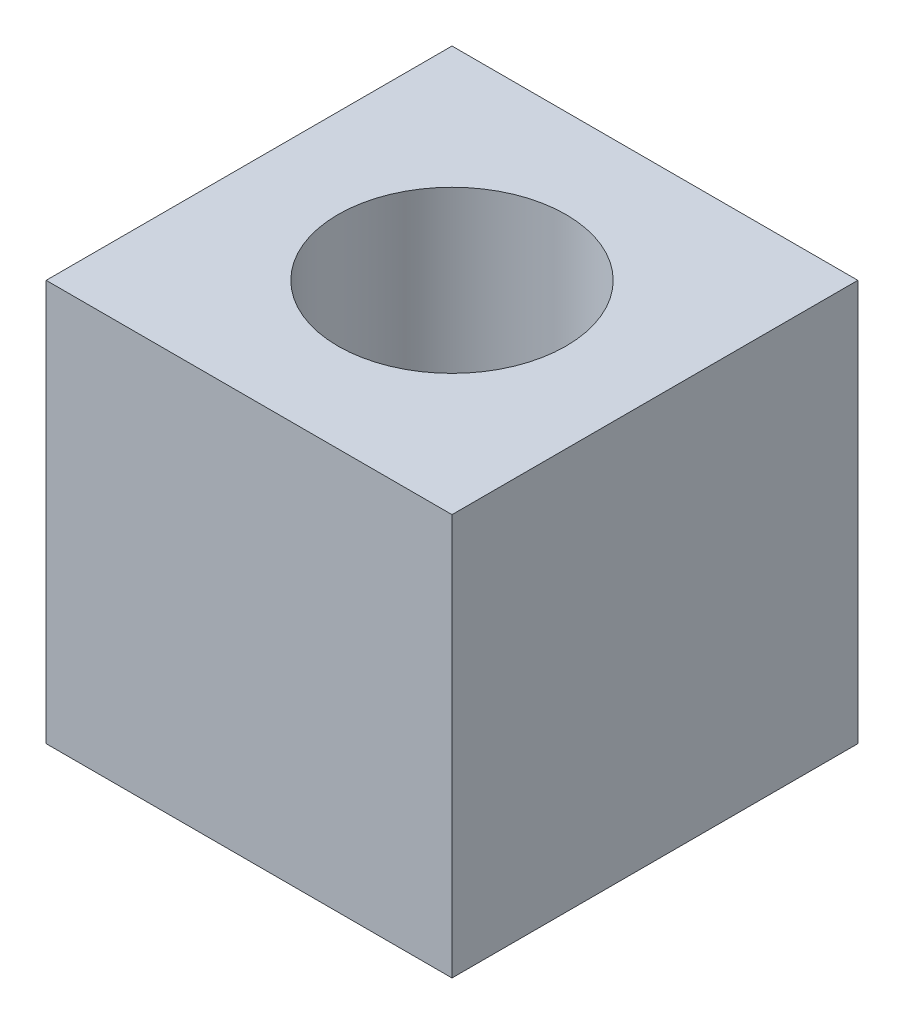
ISO-10303-21;
HEADER;
FILE_DESCRIPTION(('STEP AP214'),'2;1');
FILE_NAME('part.step','',(''),(''),'','','');
FILE_SCHEMA(('AUTOMOTIVE_DESIGN { 1 0 10303 214 1 1 1 1 }'));
ENDSEC;
DATA;
#1=APPLICATION_CONTEXT('core data for automotive mechanical design processes');
#2=APPLICATION_PROTOCOL_DEFINITION('international standard','automotive_design',2000,#1);
#3=PRODUCT_CONTEXT('',#1,'mechanical');
#4=PRODUCT('Part','Part','',(#3));
#5=PRODUCT_RELATED_PRODUCT_CATEGORY('part','',(#4));
#6=PRODUCT_DEFINITION_FORMATION('','',#4);
#7=PRODUCT_DEFINITION_CONTEXT('part definition',#1,'design');
#8=PRODUCT_DEFINITION('design','',#6,#7);
#9=PRODUCT_DEFINITION_SHAPE('','',#8);
#10=(LENGTH_UNIT() NAMED_UNIT(*) SI_UNIT(.MILLI.,.METRE.));
#11=(NAMED_UNIT(*) PLANE_ANGLE_UNIT() SI_UNIT($,.RADIAN.));
#12=(NAMED_UNIT(*) SI_UNIT($,.STERADIAN.) SOLID_ANGLE_UNIT());
#13=UNCERTAINTY_MEASURE_WITH_UNIT(LENGTH_MEASURE(1.E-05),#10,'distance_accuracy_value','');
#14=(GEOMETRIC_REPRESENTATION_CONTEXT(3) GLOBAL_UNCERTAINTY_ASSIGNED_CONTEXT((#13)) GLOBAL_UNIT_ASSIGNED_CONTEXT((#10,
#11,#12)) REPRESENTATION_CONTEXT('',''));
#15=CARTESIAN_POINT('',(0.,0.,0.));
#16=DIRECTION('',(0.,0.,1.));
#17=DIRECTION('',(1.,0.,0.));
#18=AXIS2_PLACEMENT_3D('',#15,#16,#17);
#19=CARTESIAN_POINT('',(0.,11.176,0.));
#20=DIRECTION('',(0.,-1.,0.));
#21=DIRECTION('',(0.,0.,-1.));
#22=AXIS2_PLACEMENT_3D('',#19,#20,#21);
#23=PLANE('',#22);
#24=DIRECTION('',(0.,0.,1.));
#25=VECTOR('',#24,1.);
#26=CARTESIAN_POINT('',(0.,11.176,0.));
#27=LINE('',#26,#25);
#28=CARTESIAN_POINT('',(0.,11.176,-11.303));
#29=VERTEX_POINT('',#28);
#30=CARTESIAN_POINT('',(0.,11.176,0.));
#31=VERTEX_POINT('',#30);
#32=EDGE_CURVE('E87',#29,#31,#27,.T.);
#33=ORIENTED_EDGE('',*,*,#32,.T.);
#34=DIRECTION('',(1.,0.,0.));
#35=VECTOR('',#34,1.);
#36=CARTESIAN_POINT('',(0.,11.176,0.));
#37=LINE('',#36,#35);
#38=CARTESIAN_POINT('',(11.303,11.176,0.));
#39=VERTEX_POINT('',#38);
#40=EDGE_CURVE('E82',#31,#39,#37,.T.);
#41=ORIENTED_EDGE('',*,*,#40,.T.);
#42=DIRECTION('',(0.,0.,-1.));
#43=VECTOR('',#42,1.);
#44=CARTESIAN_POINT('',(11.303,11.176,0.));
#45=LINE('',#44,#43);
#46=CARTESIAN_POINT('',(11.303,11.176,-11.303));
#47=VERTEX_POINT('',#46);
#48=EDGE_CURVE('E85',#39,#47,#45,.T.);
#49=ORIENTED_EDGE('',*,*,#48,.T.);
#50=DIRECTION('',(-1.,0.,0.));
#51=VECTOR('',#50,1.);
#52=CARTESIAN_POINT('',(0.,11.176,-11.303));
#53=LINE('',#52,#51);
#54=EDGE_CURVE('E52',#47,#29,#53,.T.);
#55=ORIENTED_EDGE('',*,*,#54,.T.);
#56=EDGE_LOOP('',(#33,#41,#49,#55));
#57=FACE_BOUND('',#56,.T.);
#58=CARTESIAN_POINT('',(5.6515,11.176,-5.6515));
#59=DIRECTION('',(0.,1.,0.));
#60=DIRECTION('',(0.,0.,1.));
#61=AXIS2_PLACEMENT_3D('',#58,#59,#60);
#62=CIRCLE('',#61,3.175);
#63=CARTESIAN_POINT('',(5.6515,11.176,-2.4765));
#64=VERTEX_POINT('',#63);
#65=EDGE_CURVE('E102',#64,#64,#62,.T.);
#66=ORIENTED_EDGE('',*,*,#65,.F.);
#67=EDGE_LOOP('',(#66));
#68=FACE_BOUND('',#67,.T.);
#69=ADVANCED_FACE('F35',(#57,#68),#23,.F.);
#70=CARTESIAN_POINT('',(0.,0.,0.));
#71=DIRECTION('',(0.,-1.,0.));
#72=DIRECTION('',(0.,0.,-1.));
#73=AXIS2_PLACEMENT_3D('',#70,#71,#72);
#74=PLANE('',#73);
#75=CARTESIAN_POINT('',(5.6515,0.,-5.6515));
#76=DIRECTION('',(0.,-1.,0.));
#77=DIRECTION('',(0.,0.,-1.));
#78=AXIS2_PLACEMENT_3D('',#75,#76,#77);
#79=CIRCLE('',#78,3.556);
#80=CARTESIAN_POINT('',(5.6515,0.,-9.2075));
#81=VERTEX_POINT('',#80);
#82=EDGE_CURVE('E121',#81,#81,#79,.F.);
#83=ORIENTED_EDGE('',*,*,#82,.T.);
#84=EDGE_LOOP('',(#83));
#85=FACE_BOUND('',#84,.T.);
#86=DIRECTION('',(0.,0.,1.));
#87=VECTOR('',#86,1.);
#88=CARTESIAN_POINT('',(0.,0.,0.));
#89=LINE('',#88,#87);
#90=CARTESIAN_POINT('',(0.,0.,-11.303));
#91=VERTEX_POINT('',#90);
#92=CARTESIAN_POINT('',(0.,0.,0.));
#93=VERTEX_POINT('',#92);
#94=EDGE_CURVE('E99',#91,#93,#89,.T.);
#95=ORIENTED_EDGE('',*,*,#94,.F.);
#96=DIRECTION('',(-1.,0.,0.));
#97=VECTOR('',#96,1.);
#98=CARTESIAN_POINT('',(0.,0.,-11.303));
#99=LINE('',#98,#97);
#100=CARTESIAN_POINT('',(11.303,0.,-11.303));
#101=VERTEX_POINT('',#100);
#102=EDGE_CURVE('E75',#101,#91,#99,.T.);
#103=ORIENTED_EDGE('',*,*,#102,.F.);
#104=DIRECTION('',(0.,0.,-1.));
#105=VECTOR('',#104,1.);
#106=CARTESIAN_POINT('',(11.303,0.,0.));
#107=LINE('',#106,#105);
#108=CARTESIAN_POINT('',(11.303,0.,0.));
#109=VERTEX_POINT('',#108);
#110=EDGE_CURVE('E69',#109,#101,#107,.T.);
#111=ORIENTED_EDGE('',*,*,#110,.F.);
#112=DIRECTION('',(1.,0.,0.));
#113=VECTOR('',#112,1.);
#114=CARTESIAN_POINT('',(0.,0.,0.));
#115=LINE('',#114,#113);
#116=EDGE_CURVE('E91',#93,#109,#115,.T.);
#117=ORIENTED_EDGE('',*,*,#116,.F.);
#118=EDGE_LOOP('',(#95,#103,#111,#117));
#119=FACE_BOUND('',#118,.T.);
#120=ADVANCED_FACE('F110',(#85,#119),#74,.T.);
#121=CARTESIAN_POINT('',(0.,11.176,0.));
#122=DIRECTION('',(1.,0.,0.));
#123=DIRECTION('',(0.,0.,-1.));
#124=AXIS2_PLACEMENT_3D('',#121,#122,#123);
#125=PLANE('',#124);
#126=ORIENTED_EDGE('',*,*,#94,.T.);
#127=DIRECTION('',(0.,-1.,0.));
#128=VECTOR('',#127,1.);
#129=CARTESIAN_POINT('',(0.,11.176,0.));
#130=LINE('',#129,#128);
#131=EDGE_CURVE('E11',#31,#93,#130,.T.);
#132=ORIENTED_EDGE('',*,*,#131,.F.);
#133=ORIENTED_EDGE('',*,*,#32,.F.);
#134=DIRECTION('',(0.,-1.,0.));
#135=VECTOR('',#134,1.);
#136=CARTESIAN_POINT('',(0.,11.176,-11.303));
#137=LINE('',#136,#135);
#138=EDGE_CURVE('E95',#29,#91,#137,.T.);
#139=ORIENTED_EDGE('',*,*,#138,.T.);
#140=EDGE_LOOP('',(#126,#132,#133,#139));
#141=FACE_BOUND('',#140,.T.);
#142=ADVANCED_FACE('F37',(#141),#125,.F.);
#143=CARTESIAN_POINT('',(0.,11.176,0.));
#144=DIRECTION('',(0.,0.,-1.));
#145=DIRECTION('',(-1.,0.,0.));
#146=AXIS2_PLACEMENT_3D('',#143,#144,#145);
#147=PLANE('',#146);
#148=ORIENTED_EDGE('',*,*,#116,.T.);
#149=DIRECTION('',(0.,-1.,0.));
#150=VECTOR('',#149,1.);
#151=CARTESIAN_POINT('',(11.303,11.176,0.));
#152=LINE('',#151,#150);
#153=EDGE_CURVE('E44',#39,#109,#152,.T.);
#154=ORIENTED_EDGE('',*,*,#153,.F.);
#155=ORIENTED_EDGE('',*,*,#40,.F.);
#156=ORIENTED_EDGE('',*,*,#131,.T.);
#157=EDGE_LOOP('',(#148,#154,#155,#156));
#158=FACE_BOUND('',#157,.T.);
#159=ADVANCED_FACE('F90',(#158),#147,.F.);
#160=CARTESIAN_POINT('',(11.303,11.176,0.));
#161=DIRECTION('',(-1.,0.,0.));
#162=DIRECTION('',(0.,0.,1.));
#163=AXIS2_PLACEMENT_3D('',#160,#161,#162);
#164=PLANE('',#163);
#165=ORIENTED_EDGE('',*,*,#110,.T.);
#166=DIRECTION('',(0.,-1.,0.));
#167=VECTOR('',#166,1.);
#168=CARTESIAN_POINT('',(11.303,11.176,-11.303));
#169=LINE('',#168,#167);
#170=EDGE_CURVE('E92',#47,#101,#169,.T.);
#171=ORIENTED_EDGE('',*,*,#170,.F.);
#172=ORIENTED_EDGE('',*,*,#48,.F.);
#173=ORIENTED_EDGE('',*,*,#153,.T.);
#174=EDGE_LOOP('',(#165,#171,#172,#173));
#175=FACE_BOUND('',#174,.T.);
#176=ADVANCED_FACE('F93',(#175),#164,.F.);
#177=CARTESIAN_POINT('',(0.,11.176,-11.303));
#178=DIRECTION('',(0.,0.,1.));
#179=DIRECTION('',(1.,0.,0.));
#180=AXIS2_PLACEMENT_3D('',#177,#178,#179);
#181=PLANE('',#180);
#182=ORIENTED_EDGE('',*,*,#102,.T.);
#183=ORIENTED_EDGE('',*,*,#138,.F.);
#184=ORIENTED_EDGE('',*,*,#54,.F.);
#185=ORIENTED_EDGE('',*,*,#170,.T.);
#186=EDGE_LOOP('',(#182,#183,#184,#185));
#187=FACE_BOUND('',#186,.T.);
#188=ADVANCED_FACE('F107',(#187),#181,.F.);
#189=CARTESIAN_POINT('',(5.6515,11.176,-5.6515));
#190=DIRECTION('',(0.,-1.,0.));
#191=DIRECTION('',(0.,0.,-1.));
#192=AXIS2_PLACEMENT_3D('',#189,#190,#191);
#193=CYLINDRICAL_SURFACE('',#192,3.175);
#194=CARTESIAN_POINT('',(5.6515,5.334,-5.6515));
#195=DIRECTION('',(0.,1.,0.));
#196=DIRECTION('',(0.,0.,1.));
#197=AXIS2_PLACEMENT_3D('',#194,#195,#196);
#198=CIRCLE('',#197,3.175);
#199=CARTESIAN_POINT('',(5.6515,5.334,-2.4765));
#200=VERTEX_POINT('',#199);
#201=EDGE_CURVE('E118',#200,#200,#198,.T.);
#202=ORIENTED_EDGE('',*,*,#201,.F.);
#203=EDGE_LOOP('',(#202));
#204=FACE_BOUND('',#203,.T.);
#205=ORIENTED_EDGE('',*,*,#65,.T.);
#206=EDGE_LOOP('',(#205));
#207=FACE_BOUND('',#206,.T.);
#208=ADVANCED_FACE('F130',(#204,#207),#193,.F.);
#209=CARTESIAN_POINT('',(5.6515,-0.00100000000000013,-5.6515));
#210=DIRECTION('',(0.,1.,0.));
#211=DIRECTION('',(0.,0.,1.));
#212=AXIS2_PLACEMENT_3D('',#209,#210,#211);
#213=CYLINDRICAL_SURFACE('',#212,3.556);
#214=ORIENTED_EDGE('',*,*,#82,.F.);
#215=EDGE_LOOP('',(#214));
#216=FACE_BOUND('',#215,.T.);
#217=CARTESIAN_POINT('',(5.6515,5.334,-5.6515));
#218=DIRECTION('',(0.,1.,0.));
#219=DIRECTION('',(0.,0.,1.));
#220=AXIS2_PLACEMENT_3D('',#217,#218,#219);
#221=CIRCLE('',#220,3.556);
#222=CARTESIAN_POINT('',(5.6515,5.334,-2.0955));
#223=VERTEX_POINT('',#222);
#224=EDGE_CURVE('E115',#223,#223,#221,.T.);
#225=ORIENTED_EDGE('',*,*,#224,.T.);
#226=EDGE_LOOP('',(#225));
#227=FACE_BOUND('',#226,.T.);
#228=ADVANCED_FACE('F126',(#216,#227),#213,.F.);
#229=CARTESIAN_POINT('',(5.6515,5.334,-5.6515));
#230=DIRECTION('',(0.,1.,0.));
#231=DIRECTION('',(0.,0.,1.));
#232=AXIS2_PLACEMENT_3D('',#229,#230,#231);
#233=PLANE('',#232);
#234=ORIENTED_EDGE('',*,*,#201,.T.);
#235=EDGE_LOOP('',(#234));
#236=FACE_BOUND('',#235,.T.);
#237=ORIENTED_EDGE('',*,*,#224,.F.);
#238=EDGE_LOOP('',(#237));
#239=FACE_BOUND('',#238,.T.);
#240=ADVANCED_FACE('F129',(#236,#239),#233,.F.);
#241=CLOSED_SHELL('',(#69,#120,#142,#159,#176,#188,#208,#228,#240));
#242=MANIFOLD_SOLID_BREP('B2',#241);
#243=ADVANCED_BREP_SHAPE_REPRESENTATION('',(#18,#242),#14);
#244=SHAPE_DEFINITION_REPRESENTATION(#9,#243);
ENDSEC;
END-ISO-10303-21;
